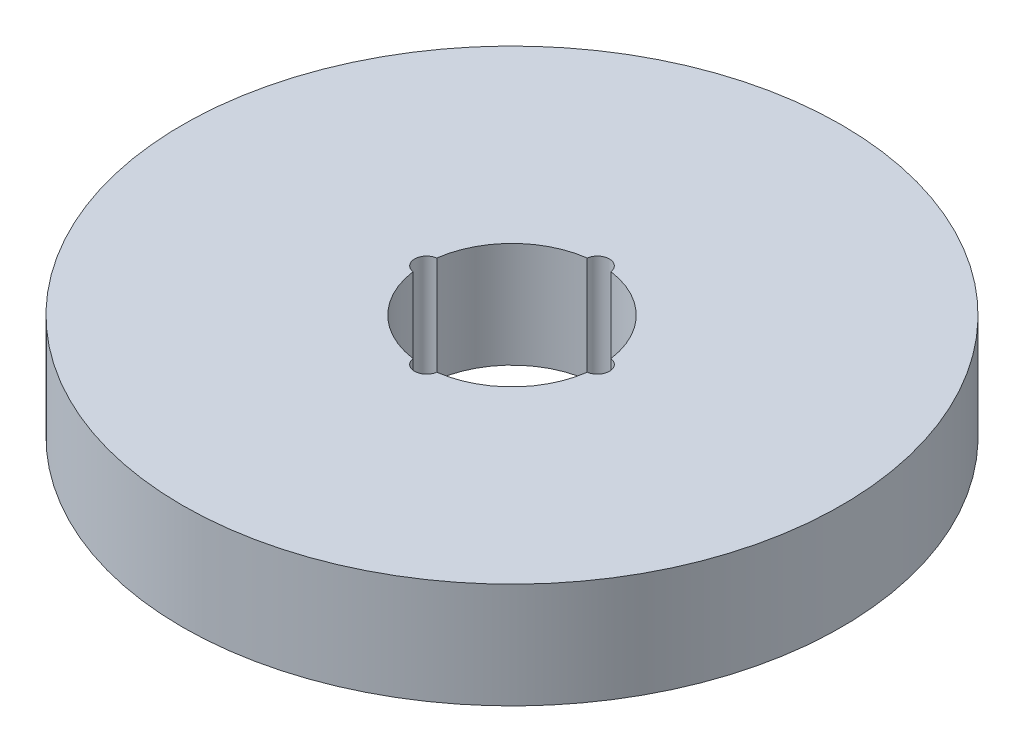
ISO-10303-21;
HEADER;
FILE_DESCRIPTION(('STEP AP214'),'2;1');
FILE_NAME('part.step','',(''),(''),'','','');
FILE_SCHEMA(('AUTOMOTIVE_DESIGN { 1 0 10303 214 1 1 1 1 }'));
ENDSEC;
DATA;
#1=APPLICATION_CONTEXT('core data for automotive mechanical design processes');
#2=APPLICATION_PROTOCOL_DEFINITION('international standard','automotive_design',2000,#1);
#3=PRODUCT_CONTEXT('',#1,'mechanical');
#4=PRODUCT('Part','Part','',(#3));
#5=PRODUCT_RELATED_PRODUCT_CATEGORY('part','',(#4));
#6=PRODUCT_DEFINITION_FORMATION('','',#4);
#7=PRODUCT_DEFINITION_CONTEXT('part definition',#1,'design');
#8=PRODUCT_DEFINITION('design','',#6,#7);
#9=PRODUCT_DEFINITION_SHAPE('','',#8);
#10=(LENGTH_UNIT() NAMED_UNIT(*) SI_UNIT(.MILLI.,.METRE.));
#11=(NAMED_UNIT(*) PLANE_ANGLE_UNIT() SI_UNIT($,.RADIAN.));
#12=(NAMED_UNIT(*) SI_UNIT($,.STERADIAN.) SOLID_ANGLE_UNIT());
#13=UNCERTAINTY_MEASURE_WITH_UNIT(LENGTH_MEASURE(1.E-05),#10,'distance_accuracy_value','');
#14=(GEOMETRIC_REPRESENTATION_CONTEXT(3) GLOBAL_UNCERTAINTY_ASSIGNED_CONTEXT((#13)) GLOBAL_UNIT_ASSIGNED_CONTEXT((#10,
#11,#12)) REPRESENTATION_CONTEXT('',''));
#15=CARTESIAN_POINT('',(0.,0.,0.));
#16=DIRECTION('',(0.,0.,1.));
#17=DIRECTION('',(1.,0.,0.));
#18=AXIS2_PLACEMENT_3D('',#15,#16,#17);
#19=CARTESIAN_POINT('',(0.,24.,0.));
#20=DIRECTION('',(0.,-1.,0.));
#21=DIRECTION('',(0.,0.,-1.));
#22=AXIS2_PLACEMENT_3D('',#19,#20,#21);
#23=CYLINDRICAL_SURFACE('',#22,75.);
#24=CARTESIAN_POINT('',(0.,24.,0.));
#25=DIRECTION('',(0.,1.,0.));
#26=DIRECTION('',(0.,0.,1.));
#27=AXIS2_PLACEMENT_3D('',#24,#25,#26);
#28=CIRCLE('',#27,75.);
#29=CARTESIAN_POINT('',(0.,24.,75.));
#30=VERTEX_POINT('',#29);
#31=EDGE_CURVE('E148',#30,#30,#28,.T.);
#32=ORIENTED_EDGE('',*,*,#31,.F.);
#33=EDGE_LOOP('',(#32));
#34=FACE_BOUND('',#33,.T.);
#35=CARTESIAN_POINT('',(0.,0.,0.));
#36=DIRECTION('',(0.,1.,0.));
#37=DIRECTION('',(0.,0.,1.));
#38=AXIS2_PLACEMENT_3D('',#35,#36,#37);
#39=CIRCLE('',#38,75.);
#40=CARTESIAN_POINT('',(0.,0.,75.));
#41=VERTEX_POINT('',#40);
#42=EDGE_CURVE('E139',#41,#41,#39,.T.);
#43=ORIENTED_EDGE('',*,*,#42,.T.);
#44=EDGE_LOOP('',(#43));
#45=FACE_BOUND('',#44,.T.);
#46=ADVANCED_FACE('F39',(#34,#45),#23,.T.);
#47=CARTESIAN_POINT('',(0.,24.,0.));
#48=DIRECTION('',(0.,1.,0.));
#49=DIRECTION('',(0.,0.,1.));
#50=AXIS2_PLACEMENT_3D('',#47,#48,#49);
#51=PLANE('',#50);
#52=CARTESIAN_POINT('',(0.,24.,19.440736975703));
#53=DIRECTION('',(0.,1.,0.));
#54=DIRECTION('',(1.,0.,0.));
#55=AXIS2_PLACEMENT_3D('',#52,#53,#54);
#56=CIRCLE('',#55,2.72219940461605);
#57=CARTESIAN_POINT('',(-2.69600679892119,24.,19.8174556222581));
#58=VERTEX_POINT('',#57);
#59=CARTESIAN_POINT('',(2.69600679892133,24.,19.8174556222581));
#60=VERTEX_POINT('',#59);
#61=EDGE_CURVE('E175',#58,#60,#56,.T.);
#62=ORIENTED_EDGE('',*,*,#61,.F.);
#63=CARTESIAN_POINT('',(0.,24.,0.));
#64=DIRECTION('',(0.,1.,0.));
#65=DIRECTION('',(0.,0.,1.));
#66=AXIS2_PLACEMENT_3D('',#63,#64,#65);
#67=CIRCLE('',#66,20.);
#68=CARTESIAN_POINT('',(-19.8174556222581,24.,2.69600679892126));
#69=VERTEX_POINT('',#68);
#70=EDGE_CURVE('E134',#69,#58,#67,.T.);
#71=ORIENTED_EDGE('',*,*,#70,.F.);
#72=CARTESIAN_POINT('',(-19.440736975703,24.,0.));
#73=DIRECTION('',(0.,1.,0.));
#74=DIRECTION('',(0.,0.,1.));
#75=AXIS2_PLACEMENT_3D('',#72,#73,#74);
#76=CIRCLE('',#75,2.72219940461605);
#77=CARTESIAN_POINT('',(-19.8174556222581,24.,-2.69600679892126));
#78=VERTEX_POINT('',#77);
#79=EDGE_CURVE('E143',#78,#69,#76,.T.);
#80=ORIENTED_EDGE('',*,*,#79,.F.);
#81=CARTESIAN_POINT('',(-2.69600679892147,24.,-19.8174556222581));
#82=VERTEX_POINT('',#81);
#83=EDGE_CURVE('E123',#82,#78,#67,.T.);
#84=ORIENTED_EDGE('',*,*,#83,.F.);
#85=CARTESIAN_POINT('',(-2.03630911092074E-13,24.,-19.440736975703));
#86=DIRECTION('',(0.,1.,0.));
#87=DIRECTION('',(-1.,0.,0.));
#88=AXIS2_PLACEMENT_3D('',#85,#86,#87);
#89=CIRCLE('',#88,2.72219940461605);
#90=CARTESIAN_POINT('',(2.69600679892105,24.,-19.8174556222582));
#91=VERTEX_POINT('',#90);
#92=EDGE_CURVE('E106',#91,#82,#89,.T.);
#93=ORIENTED_EDGE('',*,*,#92,.F.);
#94=CARTESIAN_POINT('',(19.8174556222581,24.,-2.69600679892126));
#95=VERTEX_POINT('',#94);
#96=EDGE_CURVE('E125',#95,#91,#67,.T.);
#97=ORIENTED_EDGE('',*,*,#96,.F.);
#98=CARTESIAN_POINT('',(19.440736975703,24.,0.));
#99=DIRECTION('',(0.,1.,0.));
#100=DIRECTION('',(0.,0.,-1.));
#101=AXIS2_PLACEMENT_3D('',#98,#99,#100);
#102=CIRCLE('',#101,2.72219940461605);
#103=CARTESIAN_POINT('',(19.8174556222581,24.,2.69600679892126));
#104=VERTEX_POINT('',#103);
#105=EDGE_CURVE('E286',#104,#95,#102,.T.);
#106=ORIENTED_EDGE('',*,*,#105,.F.);
#107=EDGE_CURVE('E135',#60,#104,#67,.T.);
#108=ORIENTED_EDGE('',*,*,#107,.F.);
#109=EDGE_LOOP('',(#62,#71,#80,#84,#93,#97,#106,#108));
#110=FACE_BOUND('',#109,.T.);
#111=ORIENTED_EDGE('',*,*,#31,.T.);
#112=EDGE_LOOP('',(#111));
#113=FACE_BOUND('',#112,.T.);
#114=ADVANCED_FACE('F118',(#110,#113),#51,.T.);
#115=CARTESIAN_POINT('',(0.,0.,0.));
#116=DIRECTION('',(0.,1.,0.));
#117=DIRECTION('',(0.,0.,1.));
#118=AXIS2_PLACEMENT_3D('',#115,#116,#117);
#119=PLANE('',#118);
#120=CARTESIAN_POINT('',(0.,0.,0.));
#121=DIRECTION('',(0.,1.,0.));
#122=DIRECTION('',(0.,0.,1.));
#123=AXIS2_PLACEMENT_3D('',#120,#121,#122);
#124=CIRCLE('',#123,20.);
#125=CARTESIAN_POINT('',(0.,0.,20.));
#126=VERTEX_POINT('',#125);
#127=EDGE_CURVE('E136',#126,#126,#124,.T.);
#128=ORIENTED_EDGE('',*,*,#127,.T.);
#129=EDGE_LOOP('',(#128));
#130=FACE_BOUND('',#129,.T.);
#131=ORIENTED_EDGE('',*,*,#42,.F.);
#132=EDGE_LOOP('',(#131));
#133=FACE_BOUND('',#132,.T.);
#134=ADVANCED_FACE('F187',(#130,#133),#119,.F.);
#135=CARTESIAN_POINT('',(0.,24.,0.));
#136=DIRECTION('',(0.,-1.,0.));
#137=DIRECTION('',(0.,0.,-1.));
#138=AXIS2_PLACEMENT_3D('',#135,#136,#137);
#139=CYLINDRICAL_SURFACE('',#138,20.);
#140=DIRECTION('',(0.,1.,0.));
#141=VECTOR('',#140,1.);
#142=CARTESIAN_POINT('',(-2.69600679892119,12.1868444004544,19.8174556222581));
#143=LINE('',#142,#141);
#144=CARTESIAN_POINT('',(-2.69600679892119,0.373688800908847,19.8174556222581));
#145=VERTEX_POINT('',#144);
#146=EDGE_CURVE('E11',#145,#58,#143,.T.);
#147=ORIENTED_EDGE('',*,*,#146,.F.);
#148=CARTESIAN_POINT('',(0.,0.373688800908847,0.));
#149=DIRECTION('',(0.,1.,0.));
#150=DIRECTION('',(0.,0.,1.));
#151=AXIS2_PLACEMENT_3D('',#148,#149,#150);
#152=CIRCLE('',#151,20.);
#153=CARTESIAN_POINT('',(2.69600679892133,0.373688800908847,19.8174556222581));
#154=VERTEX_POINT('',#153);
#155=EDGE_CURVE('E170',#145,#154,#152,.T.);
#156=ORIENTED_EDGE('',*,*,#155,.T.);
#157=DIRECTION('',(0.,1.,0.));
#158=VECTOR('',#157,1.);
#159=CARTESIAN_POINT('',(2.69600679892133,12.1868444004544,19.8174556222581));
#160=LINE('',#159,#158);
#161=EDGE_CURVE('E46',#60,#154,#160,.F.);
#162=ORIENTED_EDGE('',*,*,#161,.F.);
#163=ORIENTED_EDGE('',*,*,#107,.T.);
#164=DIRECTION('',(0.,1.,0.));
#165=VECTOR('',#164,1.);
#166=CARTESIAN_POINT('',(19.8174556222581,12.1868444004544,2.69600679892126));
#167=LINE('',#166,#165);
#168=CARTESIAN_POINT('',(19.8174556222581,0.373688800908847,2.69600679892126));
#169=VERTEX_POINT('',#168);
#170=EDGE_CURVE('E164',#169,#104,#167,.T.);
#171=ORIENTED_EDGE('',*,*,#170,.F.);
#172=CARTESIAN_POINT('',(0.,0.373688800908847,0.));
#173=DIRECTION('',(0.,1.,0.));
#174=DIRECTION('',(0.,0.,1.));
#175=AXIS2_PLACEMENT_3D('',#172,#173,#174);
#176=CIRCLE('',#175,20.);
#177=CARTESIAN_POINT('',(19.8174556222581,0.373688800908847,-2.69600679892126));
#178=VERTEX_POINT('',#177);
#179=EDGE_CURVE('E115',#169,#178,#176,.T.);
#180=ORIENTED_EDGE('',*,*,#179,.T.);
#181=DIRECTION('',(0.,1.,0.));
#182=VECTOR('',#181,1.);
#183=CARTESIAN_POINT('',(19.8174556222581,12.1868444004544,-2.69600679892126));
#184=LINE('',#183,#182);
#185=EDGE_CURVE('E131',#95,#178,#184,.F.);
#186=ORIENTED_EDGE('',*,*,#185,.F.);
#187=ORIENTED_EDGE('',*,*,#96,.T.);
#188=DIRECTION('',(0.,1.,0.));
#189=VECTOR('',#188,1.);
#190=CARTESIAN_POINT('',(2.69600679892105,12.1868444004544,-19.8174556222582));
#191=LINE('',#190,#189);
#192=CARTESIAN_POINT('',(2.69600679892105,0.373688800908847,-19.8174556222582));
#193=VERTEX_POINT('',#192);
#194=EDGE_CURVE('E105',#193,#91,#191,.T.);
#195=ORIENTED_EDGE('',*,*,#194,.F.);
#196=CARTESIAN_POINT('',(0.,0.373688800908847,0.));
#197=DIRECTION('',(0.,1.,0.));
#198=DIRECTION('',(0.,0.,1.));
#199=AXIS2_PLACEMENT_3D('',#196,#197,#198);
#200=CIRCLE('',#199,20.);
#201=CARTESIAN_POINT('',(-2.69600679892147,0.373688800908847,-19.8174556222581));
#202=VERTEX_POINT('',#201);
#203=EDGE_CURVE('E159',#193,#202,#200,.T.);
#204=ORIENTED_EDGE('',*,*,#203,.T.);
#205=DIRECTION('',(0.,1.,0.));
#206=VECTOR('',#205,1.);
#207=CARTESIAN_POINT('',(-2.69600679892147,12.1868444004544,-19.8174556222581));
#208=LINE('',#207,#206);
#209=EDGE_CURVE('E114',#82,#202,#208,.F.);
#210=ORIENTED_EDGE('',*,*,#209,.F.);
#211=ORIENTED_EDGE('',*,*,#83,.T.);
#212=DIRECTION('',(0.,1.,0.));
#213=VECTOR('',#212,1.);
#214=CARTESIAN_POINT('',(-19.8174556222581,12.1868444004544,-2.69600679892126));
#215=LINE('',#214,#213);
#216=CARTESIAN_POINT('',(-19.8174556222581,0.373688800908847,-2.69600679892126));
#217=VERTEX_POINT('',#216);
#218=EDGE_CURVE('E160',#217,#78,#215,.T.);
#219=ORIENTED_EDGE('',*,*,#218,.F.);
#220=CARTESIAN_POINT('',(0.,0.373688800908847,0.));
#221=DIRECTION('',(0.,1.,0.));
#222=DIRECTION('',(0.,0.,1.));
#223=AXIS2_PLACEMENT_3D('',#220,#221,#222);
#224=CIRCLE('',#223,20.);
#225=CARTESIAN_POINT('',(-19.8174556222581,0.373688800908847,2.69600679892126));
#226=VERTEX_POINT('',#225);
#227=EDGE_CURVE('E149',#217,#226,#224,.T.);
#228=ORIENTED_EDGE('',*,*,#227,.T.);
#229=DIRECTION('',(0.,1.,0.));
#230=VECTOR('',#229,1.);
#231=CARTESIAN_POINT('',(-19.8174556222581,12.1868444004544,2.69600679892126));
#232=LINE('',#231,#230);
#233=EDGE_CURVE('E152',#69,#226,#232,.F.);
#234=ORIENTED_EDGE('',*,*,#233,.F.);
#235=ORIENTED_EDGE('',*,*,#70,.T.);
#236=EDGE_LOOP('',(#147,#156,#162,#163,#171,#180,#186,#187,#195,#204,#210,#211,#219,#228,#234,#235));
#237=FACE_BOUND('',#236,.T.);
#238=ORIENTED_EDGE('',*,*,#127,.F.);
#239=EDGE_LOOP('',(#238));
#240=FACE_BOUND('',#239,.T.);
#241=ADVANCED_FACE('F126',(#237,#240),#139,.F.);
#242=CARTESIAN_POINT('',(-19.440736975703,0.373688800908847,0.));
#243=DIRECTION('',(0.,1.,0.));
#244=DIRECTION('',(0.,0.,1.));
#245=AXIS2_PLACEMENT_3D('',#242,#243,#244);
#246=CYLINDRICAL_SURFACE('',#245,2.72219940461605);
#247=ORIENTED_EDGE('',*,*,#218,.T.);
#248=ORIENTED_EDGE('',*,*,#79,.T.);
#249=ORIENTED_EDGE('',*,*,#233,.T.);
#250=CARTESIAN_POINT('',(-19.440736975703,0.373688800908847,0.));
#251=DIRECTION('',(0.,1.,0.));
#252=DIRECTION('',(0.,0.,1.));
#253=AXIS2_PLACEMENT_3D('',#250,#251,#252);
#254=CIRCLE('',#253,2.72219940461605);
#255=EDGE_CURVE('E144',#217,#226,#254,.T.);
#256=ORIENTED_EDGE('',*,*,#255,.F.);
#257=EDGE_LOOP('',(#247,#248,#249,#256));
#258=FACE_BOUND('',#257,.T.);
#259=ADVANCED_FACE('F200',(#258),#246,.F.);
#260=CARTESIAN_POINT('',(-19.440736975703,0.373688800908847,0.));
#261=DIRECTION('',(0.,1.,0.));
#262=DIRECTION('',(0.,0.,1.));
#263=AXIS2_PLACEMENT_3D('',#260,#261,#262);
#264=PLANE('',#263);
#265=ORIENTED_EDGE('',*,*,#255,.T.);
#266=ORIENTED_EDGE('',*,*,#227,.F.);
#267=EDGE_LOOP('',(#265,#266));
#268=FACE_BOUND('',#267,.T.);
#269=ADVANCED_FACE('F201',(#268),#264,.T.);
#270=CARTESIAN_POINT('',(-2.03630911092074E-13,0.373688800908847,-19.440736975703));
#271=DIRECTION('',(0.,1.,0.));
#272=DIRECTION('',(0.,0.,1.));
#273=AXIS2_PLACEMENT_3D('',#270,#271,#272);
#274=CYLINDRICAL_SURFACE('',#273,2.72219940461605);
#275=ORIENTED_EDGE('',*,*,#194,.T.);
#276=ORIENTED_EDGE('',*,*,#92,.T.);
#277=ORIENTED_EDGE('',*,*,#209,.T.);
#278=CARTESIAN_POINT('',(-2.03630911092074E-13,0.373688800908847,-19.440736975703));
#279=DIRECTION('',(0.,1.,0.));
#280=DIRECTION('',(-1.,0.,0.));
#281=AXIS2_PLACEMENT_3D('',#278,#279,#280);
#282=CIRCLE('',#281,2.72219940461605);
#283=EDGE_CURVE('E107',#193,#202,#282,.T.);
#284=ORIENTED_EDGE('',*,*,#283,.F.);
#285=EDGE_LOOP('',(#275,#276,#277,#284));
#286=FACE_BOUND('',#285,.T.);
#287=ADVANCED_FACE('F102',(#286),#274,.F.);
#288=CARTESIAN_POINT('',(-2.03630911092074E-13,0.373688800908847,-19.440736975703));
#289=DIRECTION('',(0.,1.,0.));
#290=DIRECTION('',(-1.,0.,0.));
#291=AXIS2_PLACEMENT_3D('',#288,#289,#290);
#292=PLANE('',#291);
#293=ORIENTED_EDGE('',*,*,#283,.T.);
#294=ORIENTED_EDGE('',*,*,#203,.F.);
#295=EDGE_LOOP('',(#293,#294));
#296=FACE_BOUND('',#295,.T.);
#297=ADVANCED_FACE('F209',(#296),#292,.T.);
#298=CARTESIAN_POINT('',(19.440736975703,0.373688800908847,0.));
#299=DIRECTION('',(0.,1.,0.));
#300=DIRECTION('',(0.,0.,1.));
#301=AXIS2_PLACEMENT_3D('',#298,#299,#300);
#302=CYLINDRICAL_SURFACE('',#301,2.72219940461605);
#303=ORIENTED_EDGE('',*,*,#170,.T.);
#304=ORIENTED_EDGE('',*,*,#105,.T.);
#305=ORIENTED_EDGE('',*,*,#185,.T.);
#306=CARTESIAN_POINT('',(19.440736975703,0.373688800908847,0.));
#307=DIRECTION('',(0.,1.,0.));
#308=DIRECTION('',(0.,0.,-1.));
#309=AXIS2_PLACEMENT_3D('',#306,#307,#308);
#310=CIRCLE('',#309,2.72219940461605);
#311=EDGE_CURVE('E56',#169,#178,#310,.T.);
#312=ORIENTED_EDGE('',*,*,#311,.F.);
#313=EDGE_LOOP('',(#303,#304,#305,#312));
#314=FACE_BOUND('',#313,.T.);
#315=ADVANCED_FACE('F213',(#314),#302,.F.);
#316=CARTESIAN_POINT('',(19.440736975703,0.373688800908847,0.));
#317=DIRECTION('',(0.,1.,0.));
#318=DIRECTION('',(0.,0.,-1.));
#319=AXIS2_PLACEMENT_3D('',#316,#317,#318);
#320=PLANE('',#319);
#321=ORIENTED_EDGE('',*,*,#311,.T.);
#322=ORIENTED_EDGE('',*,*,#179,.F.);
#323=EDGE_LOOP('',(#321,#322));
#324=FACE_BOUND('',#323,.T.);
#325=ADVANCED_FACE('F179',(#324),#320,.T.);
#326=CARTESIAN_POINT('',(0.,0.373688800908847,19.440736975703));
#327=DIRECTION('',(0.,1.,0.));
#328=DIRECTION('',(0.,0.,1.));
#329=AXIS2_PLACEMENT_3D('',#326,#327,#328);
#330=CYLINDRICAL_SURFACE('',#329,2.72219940461605);
#331=ORIENTED_EDGE('',*,*,#146,.T.);
#332=ORIENTED_EDGE('',*,*,#61,.T.);
#333=ORIENTED_EDGE('',*,*,#161,.T.);
#334=CARTESIAN_POINT('',(0.,0.373688800908847,19.440736975703));
#335=DIRECTION('',(0.,1.,0.));
#336=DIRECTION('',(1.,0.,0.));
#337=AXIS2_PLACEMENT_3D('',#334,#335,#336);
#338=CIRCLE('',#337,2.72219940461605);
#339=EDGE_CURVE('E55',#145,#154,#338,.T.);
#340=ORIENTED_EDGE('',*,*,#339,.F.);
#341=EDGE_LOOP('',(#331,#332,#333,#340));
#342=FACE_BOUND('',#341,.T.);
#343=ADVANCED_FACE('F171',(#342),#330,.F.);
#344=CARTESIAN_POINT('',(0.,0.373688800908847,19.440736975703));
#345=DIRECTION('',(0.,1.,0.));
#346=DIRECTION('',(1.,0.,0.));
#347=AXIS2_PLACEMENT_3D('',#344,#345,#346);
#348=PLANE('',#347);
#349=ORIENTED_EDGE('',*,*,#339,.T.);
#350=ORIENTED_EDGE('',*,*,#155,.F.);
#351=EDGE_LOOP('',(#349,#350));
#352=FACE_BOUND('',#351,.T.);
#353=ADVANCED_FACE('F173',(#352),#348,.T.);
#354=CLOSED_SHELL('',(#46,#114,#134,#241,#259,#269,#287,#297,#315,#325,#343,#353));
#355=MANIFOLD_SOLID_BREP('B2',#354);
#356=ADVANCED_BREP_SHAPE_REPRESENTATION('',(#18,#355),#14);
#357=SHAPE_DEFINITION_REPRESENTATION(#9,#356);
ENDSEC;
END-ISO-10303-21;
